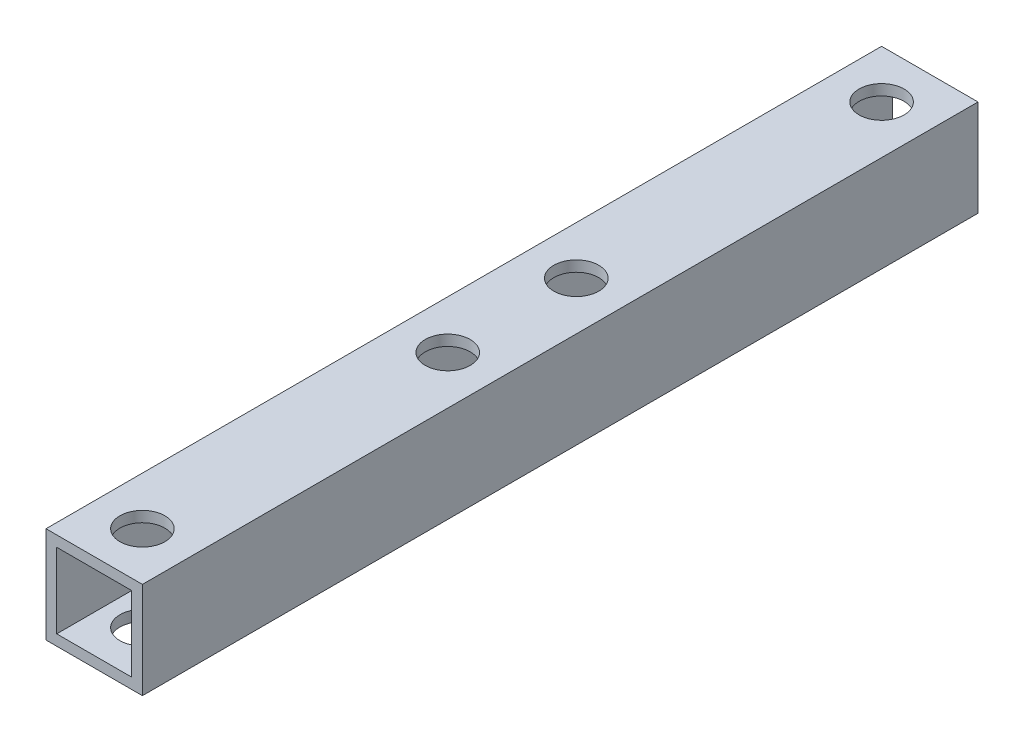
ISO-10303-21;
HEADER;
FILE_DESCRIPTION(('STEP AP214'),'2;1');
FILE_NAME('part.step','',(''),(''),'','','');
FILE_SCHEMA(('AUTOMOTIVE_DESIGN { 1 0 10303 214 1 1 1 1 }'));
ENDSEC;
DATA;
#1=APPLICATION_CONTEXT('core data for automotive mechanical design processes');
#2=APPLICATION_PROTOCOL_DEFINITION('international standard','automotive_design',2000,#1);
#3=PRODUCT_CONTEXT('',#1,'mechanical');
#4=PRODUCT('Part','Part','',(#3));
#5=PRODUCT_RELATED_PRODUCT_CATEGORY('part','',(#4));
#6=PRODUCT_DEFINITION_FORMATION('','',#4);
#7=PRODUCT_DEFINITION_CONTEXT('part definition',#1,'design');
#8=PRODUCT_DEFINITION('design','',#6,#7);
#9=PRODUCT_DEFINITION_SHAPE('','',#8);
#10=(LENGTH_UNIT() NAMED_UNIT(*) SI_UNIT(.MILLI.,.METRE.));
#11=(NAMED_UNIT(*) PLANE_ANGLE_UNIT() SI_UNIT($,.RADIAN.));
#12=(NAMED_UNIT(*) SI_UNIT($,.STERADIAN.) SOLID_ANGLE_UNIT());
#13=UNCERTAINTY_MEASURE_WITH_UNIT(LENGTH_MEASURE(1.E-05),#10,'distance_accuracy_value','');
#14=(GEOMETRIC_REPRESENTATION_CONTEXT(3) GLOBAL_UNCERTAINTY_ASSIGNED_CONTEXT((#13)) GLOBAL_UNIT_ASSIGNED_CONTEXT((#10,
#11,#12)) REPRESENTATION_CONTEXT('',''));
#15=CARTESIAN_POINT('',(0.,0.,0.));
#16=DIRECTION('',(0.,0.,1.));
#17=DIRECTION('',(1.,0.,0.));
#18=AXIS2_PLACEMENT_3D('',#15,#16,#17);
#19=CARTESIAN_POINT('',(4.5,4.5,78.));
#20=DIRECTION('',(-1.,0.,0.));
#21=DIRECTION('',(0.,0.,1.));
#22=AXIS2_PLACEMENT_3D('',#19,#20,#21);
#23=PLANE('',#22);
#24=DIRECTION('',(0.,1.,0.));
#25=VECTOR('',#24,1.);
#26=CARTESIAN_POINT('',(4.5,4.5,0.));
#27=LINE('',#26,#25);
#28=CARTESIAN_POINT('',(4.5,-4.5,0.));
#29=VERTEX_POINT('',#28);
#30=CARTESIAN_POINT('',(4.5,4.5,0.));
#31=VERTEX_POINT('',#30);
#32=EDGE_CURVE('E135',#29,#31,#27,.T.);
#33=ORIENTED_EDGE('',*,*,#32,.T.);
#34=DIRECTION('',(0.,0.,-1.));
#35=VECTOR('',#34,1.);
#36=CARTESIAN_POINT('',(4.5,4.5,78.));
#37=LINE('',#36,#35);
#38=CARTESIAN_POINT('',(4.5,4.5,78.));
#39=VERTEX_POINT('',#38);
#40=EDGE_CURVE('E11',#39,#31,#37,.T.);
#41=ORIENTED_EDGE('',*,*,#40,.F.);
#42=DIRECTION('',(0.,1.,0.));
#43=VECTOR('',#42,1.);
#44=CARTESIAN_POINT('',(4.5,4.5,78.));
#45=LINE('',#44,#43);
#46=CARTESIAN_POINT('',(4.5,-4.5,78.));
#47=VERTEX_POINT('',#46);
#48=EDGE_CURVE('E139',#47,#39,#45,.T.);
#49=ORIENTED_EDGE('',*,*,#48,.F.);
#50=DIRECTION('',(0.,0.,-1.));
#51=VECTOR('',#50,1.);
#52=CARTESIAN_POINT('',(4.5,-4.5,78.));
#53=LINE('',#52,#51);
#54=EDGE_CURVE('E149',#47,#29,#53,.T.);
#55=ORIENTED_EDGE('',*,*,#54,.T.);
#56=EDGE_LOOP('',(#33,#41,#49,#55));
#57=FACE_BOUND('',#56,.T.);
#58=ADVANCED_FACE('F33',(#57),#23,.F.);
#59=CARTESIAN_POINT('',(-4.5,4.5,78.));
#60=DIRECTION('',(0.,-1.,0.));
#61=DIRECTION('',(0.,0.,-1.));
#62=AXIS2_PLACEMENT_3D('',#59,#60,#61);
#63=PLANE('',#62);
#64=CARTESIAN_POINT('',(0.,4.5,33.));
#65=DIRECTION('',(0.,1.,0.));
#66=DIRECTION('',(0.,0.,1.));
#67=AXIS2_PLACEMENT_3D('',#64,#65,#66);
#68=CIRCLE('',#67,2.1);
#69=CARTESIAN_POINT('',(0.,4.5,35.1));
#70=VERTEX_POINT('',#69);
#71=EDGE_CURVE('E176',#70,#70,#68,.T.);
#72=ORIENTED_EDGE('',*,*,#71,.F.);
#73=EDGE_LOOP('',(#72));
#74=FACE_BOUND('',#73,.T.);
#75=CARTESIAN_POINT('',(0.,4.5,45.));
#76=DIRECTION('',(0.,1.,0.));
#77=DIRECTION('',(0.,0.,1.));
#78=AXIS2_PLACEMENT_3D('',#75,#76,#77);
#79=CIRCLE('',#78,2.1);
#80=CARTESIAN_POINT('',(0.,4.5,47.1));
#81=VERTEX_POINT('',#80);
#82=EDGE_CURVE('E183',#81,#81,#79,.T.);
#83=ORIENTED_EDGE('',*,*,#82,.F.);
#84=EDGE_LOOP('',(#83));
#85=FACE_BOUND('',#84,.T.);
#86=CARTESIAN_POINT('',(0.,4.5,4.5));
#87=DIRECTION('',(0.,1.,0.));
#88=DIRECTION('',(0.,0.,1.));
#89=AXIS2_PLACEMENT_3D('',#86,#87,#88);
#90=CIRCLE('',#89,2.1);
#91=CARTESIAN_POINT('',(0.,4.5,6.6));
#92=VERTEX_POINT('',#91);
#93=EDGE_CURVE('E168',#92,#92,#90,.T.);
#94=ORIENTED_EDGE('',*,*,#93,.F.);
#95=EDGE_LOOP('',(#94));
#96=FACE_BOUND('',#95,.T.);
#97=CARTESIAN_POINT('',(0.,4.5,73.5));
#98=DIRECTION('',(0.,1.,0.));
#99=DIRECTION('',(0.,0.,1.));
#100=AXIS2_PLACEMENT_3D('',#97,#98,#99);
#101=CIRCLE('',#100,2.1);
#102=CARTESIAN_POINT('',(0.,4.5,75.6));
#103=VERTEX_POINT('',#102);
#104=EDGE_CURVE('E198',#103,#103,#101,.T.);
#105=ORIENTED_EDGE('',*,*,#104,.F.);
#106=EDGE_LOOP('',(#105));
#107=FACE_BOUND('',#106,.T.);
#108=DIRECTION('',(-1.,0.,0.));
#109=VECTOR('',#108,1.);
#110=CARTESIAN_POINT('',(-4.5,4.5,0.));
#111=LINE('',#110,#109);
#112=CARTESIAN_POINT('',(-4.5,4.5,0.));
#113=VERTEX_POINT('',#112);
#114=EDGE_CURVE('E152',#31,#113,#111,.T.);
#115=ORIENTED_EDGE('',*,*,#114,.T.);
#116=DIRECTION('',(0.,0.,-1.));
#117=VECTOR('',#116,1.);
#118=CARTESIAN_POINT('',(-4.5,4.5,78.));
#119=LINE('',#118,#117);
#120=CARTESIAN_POINT('',(-4.5,4.5,78.));
#121=VERTEX_POINT('',#120);
#122=EDGE_CURVE('E41',#121,#113,#119,.T.);
#123=ORIENTED_EDGE('',*,*,#122,.F.);
#124=DIRECTION('',(-1.,0.,0.));
#125=VECTOR('',#124,1.);
#126=CARTESIAN_POINT('',(-4.5,4.5,78.));
#127=LINE('',#126,#125);
#128=EDGE_CURVE('E142',#39,#121,#127,.T.);
#129=ORIENTED_EDGE('',*,*,#128,.F.);
#130=ORIENTED_EDGE('',*,*,#40,.T.);
#131=EDGE_LOOP('',(#115,#123,#129,#130));
#132=FACE_BOUND('',#131,.T.);
#133=ADVANCED_FACE('F236',(#74,#85,#96,#107,#132),#63,.F.);
#134=CARTESIAN_POINT('',(-4.5,4.5,78.));
#135=DIRECTION('',(1.,0.,0.));
#136=DIRECTION('',(0.,1.,0.));
#137=AXIS2_PLACEMENT_3D('',#134,#135,#136);
#138=PLANE('',#137);
#139=DIRECTION('',(0.,-1.,0.));
#140=VECTOR('',#139,1.);
#141=CARTESIAN_POINT('',(-4.5,4.5,0.));
#142=LINE('',#141,#140);
#143=CARTESIAN_POINT('',(-4.5,-4.5,0.));
#144=VERTEX_POINT('',#143);
#145=EDGE_CURVE('E154',#113,#144,#142,.T.);
#146=ORIENTED_EDGE('',*,*,#145,.T.);
#147=DIRECTION('',(0.,0.,-1.));
#148=VECTOR('',#147,1.);
#149=CARTESIAN_POINT('',(-4.5,-4.5,78.));
#150=LINE('',#149,#148);
#151=CARTESIAN_POINT('',(-4.5,-4.5,78.));
#152=VERTEX_POINT('',#151);
#153=EDGE_CURVE('E159',#152,#144,#150,.T.);
#154=ORIENTED_EDGE('',*,*,#153,.F.);
#155=DIRECTION('',(0.,-1.,0.));
#156=VECTOR('',#155,1.);
#157=CARTESIAN_POINT('',(-4.5,4.5,78.));
#158=LINE('',#157,#156);
#159=EDGE_CURVE('E145',#121,#152,#158,.T.);
#160=ORIENTED_EDGE('',*,*,#159,.F.);
#161=ORIENTED_EDGE('',*,*,#122,.T.);
#162=EDGE_LOOP('',(#146,#154,#160,#161));
#163=FACE_BOUND('',#162,.T.);
#164=ADVANCED_FACE('F241',(#163),#138,.F.);
#165=CARTESIAN_POINT('',(-4.5,-4.5,78.));
#166=DIRECTION('',(0.,1.,0.));
#167=DIRECTION('',(0.,0.,1.));
#168=AXIS2_PLACEMENT_3D('',#165,#166,#167);
#169=PLANE('',#168);
#170=CARTESIAN_POINT('',(0.,-4.5,33.));
#171=DIRECTION('',(0.,1.,0.));
#172=DIRECTION('',(0.,0.,1.));
#173=AXIS2_PLACEMENT_3D('',#170,#171,#172);
#174=CIRCLE('',#173,2.1);
#175=CARTESIAN_POINT('',(0.,-4.5,35.1));
#176=VERTEX_POINT('',#175);
#177=EDGE_CURVE('E195',#176,#176,#174,.T.);
#178=ORIENTED_EDGE('',*,*,#177,.T.);
#179=EDGE_LOOP('',(#178));
#180=FACE_BOUND('',#179,.T.);
#181=CARTESIAN_POINT('',(0.,-4.5,45.));
#182=DIRECTION('',(0.,1.,0.));
#183=DIRECTION('',(0.,0.,1.));
#184=AXIS2_PLACEMENT_3D('',#181,#182,#183);
#185=CIRCLE('',#184,2.1);
#186=CARTESIAN_POINT('',(0.,-4.5,47.1));
#187=VERTEX_POINT('',#186);
#188=EDGE_CURVE('E180',#187,#187,#185,.T.);
#189=ORIENTED_EDGE('',*,*,#188,.T.);
#190=EDGE_LOOP('',(#189));
#191=FACE_BOUND('',#190,.T.);
#192=CARTESIAN_POINT('',(0.,-4.5,4.5));
#193=DIRECTION('',(0.,1.,0.));
#194=DIRECTION('',(0.,0.,1.));
#195=AXIS2_PLACEMENT_3D('',#192,#193,#194);
#196=CIRCLE('',#195,2.1);
#197=CARTESIAN_POINT('',(0.,-4.5,6.6));
#198=VERTEX_POINT('',#197);
#199=EDGE_CURVE('E123',#198,#198,#196,.T.);
#200=ORIENTED_EDGE('',*,*,#199,.T.);
#201=EDGE_LOOP('',(#200));
#202=FACE_BOUND('',#201,.T.);
#203=CARTESIAN_POINT('',(0.,-4.5,73.5));
#204=DIRECTION('',(0.,1.,0.));
#205=DIRECTION('',(0.,0.,1.));
#206=AXIS2_PLACEMENT_3D('',#203,#204,#205);
#207=CIRCLE('',#206,2.1);
#208=CARTESIAN_POINT('',(0.,-4.5,75.6));
#209=VERTEX_POINT('',#208);
#210=EDGE_CURVE('E172',#209,#209,#207,.T.);
#211=ORIENTED_EDGE('',*,*,#210,.T.);
#212=EDGE_LOOP('',(#211));
#213=FACE_BOUND('',#212,.T.);
#214=DIRECTION('',(1.,0.,0.));
#215=VECTOR('',#214,1.);
#216=CARTESIAN_POINT('',(-4.5,-4.5,0.));
#217=LINE('',#216,#215);
#218=EDGE_CURVE('E143',#144,#29,#217,.T.);
#219=ORIENTED_EDGE('',*,*,#218,.T.);
#220=ORIENTED_EDGE('',*,*,#54,.F.);
#221=DIRECTION('',(1.,0.,0.));
#222=VECTOR('',#221,1.);
#223=CARTESIAN_POINT('',(-4.5,-4.5,78.));
#224=LINE('',#223,#222);
#225=EDGE_CURVE('E147',#152,#47,#224,.T.);
#226=ORIENTED_EDGE('',*,*,#225,.F.);
#227=ORIENTED_EDGE('',*,*,#153,.T.);
#228=EDGE_LOOP('',(#219,#220,#226,#227));
#229=FACE_BOUND('',#228,.T.);
#230=ADVANCED_FACE('F212',(#180,#191,#202,#213,#229),#169,.F.);
#231=CARTESIAN_POINT('',(0.,0.,78.));
#232=DIRECTION('',(0.,0.,1.));
#233=DIRECTION('',(1.,0.,0.));
#234=AXIS2_PLACEMENT_3D('',#231,#232,#233);
#235=PLANE('',#234);
#236=DIRECTION('',(0.,1.,0.));
#237=VECTOR('',#236,1.);
#238=CARTESIAN_POINT('',(3.5,3.5,78.));
#239=LINE('',#238,#237);
#240=CARTESIAN_POINT('',(3.5,-3.5,78.));
#241=VERTEX_POINT('',#240);
#242=CARTESIAN_POINT('',(3.5,3.5,78.));
#243=VERTEX_POINT('',#242);
#244=EDGE_CURVE('E49',#241,#243,#239,.T.);
#245=ORIENTED_EDGE('',*,*,#244,.F.);
#246=DIRECTION('',(1.,0.,0.));
#247=VECTOR('',#246,1.);
#248=CARTESIAN_POINT('',(-3.5,-3.5,78.));
#249=LINE('',#248,#247);
#250=CARTESIAN_POINT('',(-3.5,-3.5,78.));
#251=VERTEX_POINT('',#250);
#252=EDGE_CURVE('E117',#251,#241,#249,.T.);
#253=ORIENTED_EDGE('',*,*,#252,.F.);
#254=DIRECTION('',(0.,-1.,0.));
#255=VECTOR('',#254,1.);
#256=CARTESIAN_POINT('',(-3.5,3.5,78.));
#257=LINE('',#256,#255);
#258=CARTESIAN_POINT('',(-3.5,3.5,78.));
#259=VERTEX_POINT('',#258);
#260=EDGE_CURVE('E120',#259,#251,#257,.T.);
#261=ORIENTED_EDGE('',*,*,#260,.F.);
#262=DIRECTION('',(-1.,0.,0.));
#263=VECTOR('',#262,1.);
#264=CARTESIAN_POINT('',(-3.5,3.5,78.));
#265=LINE('',#264,#263);
#266=EDGE_CURVE('E129',#243,#259,#265,.T.);
#267=ORIENTED_EDGE('',*,*,#266,.F.);
#268=EDGE_LOOP('',(#245,#253,#261,#267));
#269=FACE_BOUND('',#268,.T.);
#270=ORIENTED_EDGE('',*,*,#48,.T.);
#271=ORIENTED_EDGE('',*,*,#128,.T.);
#272=ORIENTED_EDGE('',*,*,#159,.T.);
#273=ORIENTED_EDGE('',*,*,#225,.T.);
#274=EDGE_LOOP('',(#270,#271,#272,#273));
#275=FACE_BOUND('',#274,.T.);
#276=ADVANCED_FACE('F253',(#269,#275),#235,.T.);
#277=CARTESIAN_POINT('',(0.,0.,0.));
#278=DIRECTION('',(0.,0.,1.));
#279=DIRECTION('',(1.,0.,0.));
#280=AXIS2_PLACEMENT_3D('',#277,#278,#279);
#281=PLANE('',#280);
#282=DIRECTION('',(1.,0.,0.));
#283=VECTOR('',#282,1.);
#284=CARTESIAN_POINT('',(-3.5,-3.5,0.));
#285=LINE('',#284,#283);
#286=CARTESIAN_POINT('',(-3.5,-3.5,0.));
#287=VERTEX_POINT('',#286);
#288=CARTESIAN_POINT('',(3.5,-3.5,0.));
#289=VERTEX_POINT('',#288);
#290=EDGE_CURVE('E107',#287,#289,#285,.T.);
#291=ORIENTED_EDGE('',*,*,#290,.T.);
#292=DIRECTION('',(0.,1.,0.));
#293=VECTOR('',#292,1.);
#294=CARTESIAN_POINT('',(3.5,3.5,0.));
#295=LINE('',#294,#293);
#296=CARTESIAN_POINT('',(3.5,3.5,0.));
#297=VERTEX_POINT('',#296);
#298=EDGE_CURVE('E101',#289,#297,#295,.T.);
#299=ORIENTED_EDGE('',*,*,#298,.T.);
#300=DIRECTION('',(-1.,0.,0.));
#301=VECTOR('',#300,1.);
#302=CARTESIAN_POINT('',(-3.5,3.5,0.));
#303=LINE('',#302,#301);
#304=CARTESIAN_POINT('',(-3.5,3.5,0.));
#305=VERTEX_POINT('',#304);
#306=EDGE_CURVE('E110',#297,#305,#303,.T.);
#307=ORIENTED_EDGE('',*,*,#306,.T.);
#308=DIRECTION('',(0.,-1.,0.));
#309=VECTOR('',#308,1.);
#310=CARTESIAN_POINT('',(-3.5,3.5,0.));
#311=LINE('',#310,#309);
#312=EDGE_CURVE('E57',#305,#287,#311,.T.);
#313=ORIENTED_EDGE('',*,*,#312,.T.);
#314=EDGE_LOOP('',(#291,#299,#307,#313));
#315=FACE_BOUND('',#314,.T.);
#316=ORIENTED_EDGE('',*,*,#32,.F.);
#317=ORIENTED_EDGE('',*,*,#218,.F.);
#318=ORIENTED_EDGE('',*,*,#145,.F.);
#319=ORIENTED_EDGE('',*,*,#114,.F.);
#320=EDGE_LOOP('',(#316,#317,#318,#319));
#321=FACE_BOUND('',#320,.T.);
#322=ADVANCED_FACE('F114',(#315,#321),#281,.F.);
#323=CARTESIAN_POINT('',(3.5,3.5,0.));
#324=DIRECTION('',(1.,0.,0.));
#325=DIRECTION('',(0.,1.,0.));
#326=AXIS2_PLACEMENT_3D('',#323,#324,#325);
#327=PLANE('',#326);
#328=ORIENTED_EDGE('',*,*,#244,.T.);
#329=DIRECTION('',(0.,0.,1.));
#330=VECTOR('',#329,1.);
#331=CARTESIAN_POINT('',(3.5,3.5,0.));
#332=LINE('',#331,#330);
#333=EDGE_CURVE('E97',#297,#243,#332,.T.);
#334=ORIENTED_EDGE('',*,*,#333,.F.);
#335=ORIENTED_EDGE('',*,*,#298,.F.);
#336=DIRECTION('',(0.,0.,1.));
#337=VECTOR('',#336,1.);
#338=CARTESIAN_POINT('',(3.5,-3.5,0.));
#339=LINE('',#338,#337);
#340=EDGE_CURVE('E133',#289,#241,#339,.T.);
#341=ORIENTED_EDGE('',*,*,#340,.T.);
#342=EDGE_LOOP('',(#328,#334,#335,#341));
#343=FACE_BOUND('',#342,.T.);
#344=ADVANCED_FACE('F99',(#343),#327,.F.);
#345=CARTESIAN_POINT('',(-3.5,-3.5,0.));
#346=DIRECTION('',(0.,-1.,0.));
#347=DIRECTION('',(0.,0.,-1.));
#348=AXIS2_PLACEMENT_3D('',#345,#346,#347);
#349=PLANE('',#348);
#350=CARTESIAN_POINT('',(0.,-3.5,33.));
#351=DIRECTION('',(0.,-1.,0.));
#352=DIRECTION('',(0.,0.,-1.));
#353=AXIS2_PLACEMENT_3D('',#350,#351,#352);
#354=CIRCLE('',#353,2.1);
#355=CARTESIAN_POINT('',(0.,-3.5,30.9));
#356=VERTEX_POINT('',#355);
#357=EDGE_CURVE('E192',#356,#356,#354,.T.);
#358=ORIENTED_EDGE('',*,*,#357,.T.);
#359=EDGE_LOOP('',(#358));
#360=FACE_BOUND('',#359,.T.);
#361=CARTESIAN_POINT('',(0.,-3.5,45.));
#362=DIRECTION('',(0.,-1.,0.));
#363=DIRECTION('',(0.,0.,-1.));
#364=AXIS2_PLACEMENT_3D('',#361,#362,#363);
#365=CIRCLE('',#364,2.1);
#366=CARTESIAN_POINT('',(0.,-3.5,42.9));
#367=VERTEX_POINT('',#366);
#368=EDGE_CURVE('E175',#367,#367,#365,.T.);
#369=ORIENTED_EDGE('',*,*,#368,.T.);
#370=EDGE_LOOP('',(#369));
#371=FACE_BOUND('',#370,.T.);
#372=CARTESIAN_POINT('',(0.,-3.5,4.5));
#373=DIRECTION('',(0.,-1.,0.));
#374=DIRECTION('',(0.,0.,-1.));
#375=AXIS2_PLACEMENT_3D('',#372,#373,#374);
#376=CIRCLE('',#375,2.1);
#377=CARTESIAN_POINT('',(0.,-3.5,2.4));
#378=VERTEX_POINT('',#377);
#379=EDGE_CURVE('E171',#378,#378,#376,.T.);
#380=ORIENTED_EDGE('',*,*,#379,.T.);
#381=EDGE_LOOP('',(#380));
#382=FACE_BOUND('',#381,.T.);
#383=CARTESIAN_POINT('',(0.,-3.5,73.5));
#384=DIRECTION('',(0.,-1.,0.));
#385=DIRECTION('',(0.,0.,-1.));
#386=AXIS2_PLACEMENT_3D('',#383,#384,#385);
#387=CIRCLE('',#386,2.1);
#388=CARTESIAN_POINT('',(0.,-3.5,71.4));
#389=VERTEX_POINT('',#388);
#390=EDGE_CURVE('E167',#389,#389,#387,.T.);
#391=ORIENTED_EDGE('',*,*,#390,.T.);
#392=EDGE_LOOP('',(#391));
#393=FACE_BOUND('',#392,.T.);
#394=ORIENTED_EDGE('',*,*,#252,.T.);
#395=ORIENTED_EDGE('',*,*,#340,.F.);
#396=ORIENTED_EDGE('',*,*,#290,.F.);
#397=DIRECTION('',(0.,0.,1.));
#398=VECTOR('',#397,1.);
#399=CARTESIAN_POINT('',(-3.5,-3.5,0.));
#400=LINE('',#399,#398);
#401=EDGE_CURVE('E136',#287,#251,#400,.T.);
#402=ORIENTED_EDGE('',*,*,#401,.T.);
#403=EDGE_LOOP('',(#394,#395,#396,#402));
#404=FACE_BOUND('',#403,.T.);
#405=ADVANCED_FACE('F273',(#360,#371,#382,#393,#404),#349,.F.);
#406=CARTESIAN_POINT('',(-3.5,3.5,0.));
#407=DIRECTION('',(-1.,0.,0.));
#408=DIRECTION('',(0.,-1.,0.));
#409=AXIS2_PLACEMENT_3D('',#406,#407,#408);
#410=PLANE('',#409);
#411=ORIENTED_EDGE('',*,*,#260,.T.);
#412=ORIENTED_EDGE('',*,*,#401,.F.);
#413=ORIENTED_EDGE('',*,*,#312,.F.);
#414=DIRECTION('',(0.,0.,1.));
#415=VECTOR('',#414,1.);
#416=CARTESIAN_POINT('',(-3.5,3.5,0.));
#417=LINE('',#416,#415);
#418=EDGE_CURVE('E106',#305,#259,#417,.T.);
#419=ORIENTED_EDGE('',*,*,#418,.T.);
#420=EDGE_LOOP('',(#411,#412,#413,#419));
#421=FACE_BOUND('',#420,.T.);
#422=ADVANCED_FACE('F276',(#421),#410,.F.);
#423=CARTESIAN_POINT('',(-3.5,3.5,0.));
#424=DIRECTION('',(0.,1.,0.));
#425=DIRECTION('',(0.,0.,1.));
#426=AXIS2_PLACEMENT_3D('',#423,#424,#425);
#427=PLANE('',#426);
#428=CARTESIAN_POINT('',(0.,3.5,33.));
#429=DIRECTION('',(0.,1.,0.));
#430=DIRECTION('',(0.,0.,1.));
#431=AXIS2_PLACEMENT_3D('',#428,#429,#430);
#432=CIRCLE('',#431,2.1);
#433=CARTESIAN_POINT('',(0.,3.5,35.1));
#434=VERTEX_POINT('',#433);
#435=EDGE_CURVE('E36',#434,#434,#432,.T.);
#436=ORIENTED_EDGE('',*,*,#435,.T.);
#437=EDGE_LOOP('',(#436));
#438=FACE_BOUND('',#437,.T.);
#439=CARTESIAN_POINT('',(0.,3.5,45.));
#440=DIRECTION('',(0.,1.,0.));
#441=DIRECTION('',(0.,0.,1.));
#442=AXIS2_PLACEMENT_3D('',#439,#440,#441);
#443=CIRCLE('',#442,2.1);
#444=CARTESIAN_POINT('',(0.,3.5,47.1));
#445=VERTEX_POINT('',#444);
#446=EDGE_CURVE('E173',#445,#445,#443,.T.);
#447=ORIENTED_EDGE('',*,*,#446,.T.);
#448=EDGE_LOOP('',(#447));
#449=FACE_BOUND('',#448,.T.);
#450=CARTESIAN_POINT('',(0.,3.5,4.5));
#451=DIRECTION('',(0.,1.,0.));
#452=DIRECTION('',(0.,0.,1.));
#453=AXIS2_PLACEMENT_3D('',#450,#451,#452);
#454=CIRCLE('',#453,2.1);
#455=CARTESIAN_POINT('',(0.,3.5,6.6));
#456=VERTEX_POINT('',#455);
#457=EDGE_CURVE('E169',#456,#456,#454,.T.);
#458=ORIENTED_EDGE('',*,*,#457,.T.);
#459=EDGE_LOOP('',(#458));
#460=FACE_BOUND('',#459,.T.);
#461=CARTESIAN_POINT('',(0.,3.5,73.5));
#462=DIRECTION('',(0.,1.,0.));
#463=DIRECTION('',(0.,0.,1.));
#464=AXIS2_PLACEMENT_3D('',#461,#462,#463);
#465=CIRCLE('',#464,2.1);
#466=CARTESIAN_POINT('',(0.,3.5,75.6));
#467=VERTEX_POINT('',#466);
#468=EDGE_CURVE('E164',#467,#467,#465,.T.);
#469=ORIENTED_EDGE('',*,*,#468,.T.);
#470=EDGE_LOOP('',(#469));
#471=FACE_BOUND('',#470,.T.);
#472=ORIENTED_EDGE('',*,*,#266,.T.);
#473=ORIENTED_EDGE('',*,*,#418,.F.);
#474=ORIENTED_EDGE('',*,*,#306,.F.);
#475=ORIENTED_EDGE('',*,*,#333,.T.);
#476=EDGE_LOOP('',(#472,#473,#474,#475));
#477=FACE_BOUND('',#476,.T.);
#478=ADVANCED_FACE('F111',(#438,#449,#460,#471,#477),#427,.F.);
#479=CARTESIAN_POINT('',(0.,-70.5,73.5));
#480=DIRECTION('',(0.,1.,0.));
#481=DIRECTION('',(0.,0.,1.));
#482=AXIS2_PLACEMENT_3D('',#479,#480,#481);
#483=CYLINDRICAL_SURFACE('',#482,2.1);
#484=ORIENTED_EDGE('',*,*,#104,.T.);
#485=EDGE_LOOP('',(#484));
#486=FACE_BOUND('',#485,.T.);
#487=ORIENTED_EDGE('',*,*,#468,.F.);
#488=EDGE_LOOP('',(#487));
#489=FACE_BOUND('',#488,.T.);
#490=ADVANCED_FACE('F232',(#486,#489),#483,.F.);
#491=CARTESIAN_POINT('',(0.,-70.5,4.5));
#492=DIRECTION('',(0.,1.,0.));
#493=DIRECTION('',(0.,0.,1.));
#494=AXIS2_PLACEMENT_3D('',#491,#492,#493);
#495=CYLINDRICAL_SURFACE('',#494,2.1);
#496=ORIENTED_EDGE('',*,*,#93,.T.);
#497=EDGE_LOOP('',(#496));
#498=FACE_BOUND('',#497,.T.);
#499=ORIENTED_EDGE('',*,*,#457,.F.);
#500=EDGE_LOOP('',(#499));
#501=FACE_BOUND('',#500,.T.);
#502=ADVANCED_FACE('F221',(#498,#501),#495,.F.);
#503=ORIENTED_EDGE('',*,*,#390,.F.);
#504=EDGE_LOOP('',(#503));
#505=FACE_BOUND('',#504,.T.);
#506=ORIENTED_EDGE('',*,*,#210,.F.);
#507=EDGE_LOOP('',(#506));
#508=FACE_BOUND('',#507,.T.);
#509=ADVANCED_FACE('F218',(#505,#508),#483,.F.);
#510=ORIENTED_EDGE('',*,*,#379,.F.);
#511=EDGE_LOOP('',(#510));
#512=FACE_BOUND('',#511,.T.);
#513=ORIENTED_EDGE('',*,*,#199,.F.);
#514=EDGE_LOOP('',(#513));
#515=FACE_BOUND('',#514,.T.);
#516=ADVANCED_FACE('F215',(#512,#515),#495,.F.);
#517=CARTESIAN_POINT('',(0.,-70.5,45.));
#518=DIRECTION('',(0.,1.,0.));
#519=DIRECTION('',(0.,0.,1.));
#520=AXIS2_PLACEMENT_3D('',#517,#518,#519);
#521=CYLINDRICAL_SURFACE('',#520,2.1);
#522=ORIENTED_EDGE('',*,*,#82,.T.);
#523=EDGE_LOOP('',(#522));
#524=FACE_BOUND('',#523,.T.);
#525=ORIENTED_EDGE('',*,*,#446,.F.);
#526=EDGE_LOOP('',(#525));
#527=FACE_BOUND('',#526,.T.);
#528=ADVANCED_FACE('F217',(#524,#527),#521,.F.);
#529=CARTESIAN_POINT('',(0.,-70.5,33.));
#530=DIRECTION('',(0.,1.,0.));
#531=DIRECTION('',(0.,0.,1.));
#532=AXIS2_PLACEMENT_3D('',#529,#530,#531);
#533=CYLINDRICAL_SURFACE('',#532,2.1);
#534=ORIENTED_EDGE('',*,*,#71,.T.);
#535=EDGE_LOOP('',(#534));
#536=FACE_BOUND('',#535,.T.);
#537=ORIENTED_EDGE('',*,*,#435,.F.);
#538=EDGE_LOOP('',(#537));
#539=FACE_BOUND('',#538,.T.);
#540=ADVANCED_FACE('F226',(#536,#539),#533,.F.);
#541=ORIENTED_EDGE('',*,*,#368,.F.);
#542=EDGE_LOOP('',(#541));
#543=FACE_BOUND('',#542,.T.);
#544=ORIENTED_EDGE('',*,*,#188,.F.);
#545=EDGE_LOOP('',(#544));
#546=FACE_BOUND('',#545,.T.);
#547=ADVANCED_FACE('F229',(#543,#546),#521,.F.);
#548=ORIENTED_EDGE('',*,*,#357,.F.);
#549=EDGE_LOOP('',(#548));
#550=FACE_BOUND('',#549,.T.);
#551=ORIENTED_EDGE('',*,*,#177,.F.);
#552=EDGE_LOOP('',(#551));
#553=FACE_BOUND('',#552,.T.);
#554=ADVANCED_FACE('F297',(#550,#553),#533,.F.);
#555=CLOSED_SHELL('',(#58,#133,#164,#230,#276,#322,#344,#405,#422,#478,#490,#502,#509,#516,#528,
#540,#547,#554));
#556=MANIFOLD_SOLID_BREP('B2',#555);
#557=ADVANCED_BREP_SHAPE_REPRESENTATION('',(#18,#556),#14);
#558=SHAPE_DEFINITION_REPRESENTATION(#9,#557);
ENDSEC;
END-ISO-10303-21;
